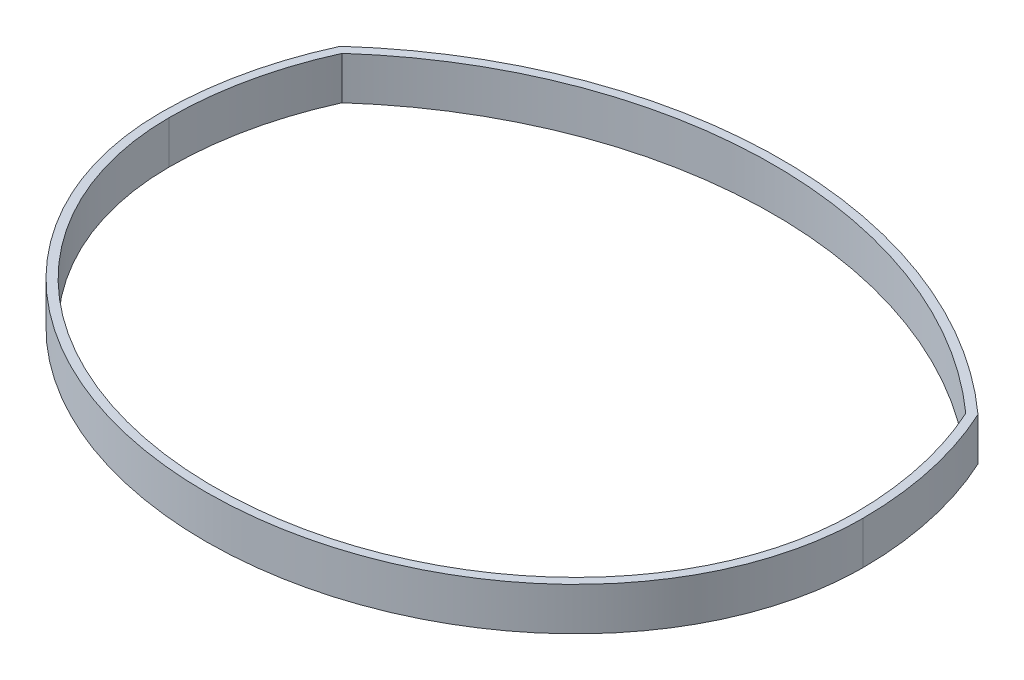
ISO-10303-21;
HEADER;
FILE_DESCRIPTION(('STEP AP214'),'2;1');
FILE_NAME('part.step','',(''),(''),'','','');
FILE_SCHEMA(('AUTOMOTIVE_DESIGN { 1 0 10303 214 1 1 1 1 }'));
ENDSEC;
DATA;
#1=APPLICATION_CONTEXT('core data for automotive mechanical design processes');
#2=APPLICATION_PROTOCOL_DEFINITION('international standard','automotive_design',2000,#1);
#3=PRODUCT_CONTEXT('',#1,'mechanical');
#4=PRODUCT('Part','Part','',(#3));
#5=PRODUCT_RELATED_PRODUCT_CATEGORY('part','',(#4));
#6=PRODUCT_DEFINITION_FORMATION('','',#4);
#7=PRODUCT_DEFINITION_CONTEXT('part definition',#1,'design');
#8=PRODUCT_DEFINITION('design','',#6,#7);
#9=PRODUCT_DEFINITION_SHAPE('','',#8);
#10=(LENGTH_UNIT() NAMED_UNIT(*) SI_UNIT(.MILLI.,.METRE.));
#11=(NAMED_UNIT(*) PLANE_ANGLE_UNIT() SI_UNIT($,.RADIAN.));
#12=(NAMED_UNIT(*) SI_UNIT($,.STERADIAN.) SOLID_ANGLE_UNIT());
#13=UNCERTAINTY_MEASURE_WITH_UNIT(LENGTH_MEASURE(1.E-05),#10,'distance_accuracy_value','');
#14=(GEOMETRIC_REPRESENTATION_CONTEXT(3) GLOBAL_UNCERTAINTY_ASSIGNED_CONTEXT((#13)) GLOBAL_UNIT_ASSIGNED_CONTEXT((#10,
#11,#12)) REPRESENTATION_CONTEXT('',''));
#15=CARTESIAN_POINT('',(0.,0.,0.));
#16=DIRECTION('',(0.,0.,1.));
#17=DIRECTION('',(1.,0.,0.));
#18=AXIS2_PLACEMENT_3D('',#15,#16,#17);
#19=CARTESIAN_POINT('',(0.,12.7,0.));
#20=DIRECTION('',(0.,-1.,0.));
#21=DIRECTION('',(0.,0.,-1.));
#22=AXIS2_PLACEMENT_3D('',#19,#20,#21);
#23=CYLINDRICAL_SURFACE('',#22,104.14);
#24=CARTESIAN_POINT('',(0.,0.,0.));
#25=DIRECTION('',(0.,1.,0.));
#26=DIRECTION('',(0.,0.,1.));
#27=AXIS2_PLACEMENT_3D('',#24,#25,#26);
#28=CIRCLE('',#27,104.14);
#29=CARTESIAN_POINT('',(-94.5401465283261,0.,-43.6726492716279));
#30=VERTEX_POINT('',#29);
#31=CARTESIAN_POINT('',(-104.14,0.,0.));
#32=VERTEX_POINT('',#31);
#33=EDGE_CURVE('E160',#30,#32,#28,.T.);
#34=ORIENTED_EDGE('',*,*,#33,.T.);
#35=DIRECTION('',(0.,-1.,0.));
#36=VECTOR('',#35,1.);
#37=CARTESIAN_POINT('',(-104.14,12.7,0.));
#38=LINE('',#37,#36);
#39=CARTESIAN_POINT('',(-104.14,12.7,0.));
#40=VERTEX_POINT('',#39);
#41=EDGE_CURVE('E11',#40,#32,#38,.T.);
#42=ORIENTED_EDGE('',*,*,#41,.F.);
#43=CARTESIAN_POINT('',(0.,12.7,0.));
#44=DIRECTION('',(0.,1.,0.));
#45=DIRECTION('',(0.,0.,1.));
#46=AXIS2_PLACEMENT_3D('',#43,#44,#45);
#47=CIRCLE('',#46,104.14);
#48=CARTESIAN_POINT('',(-94.5401465283261,12.7,-43.6726492716279));
#49=VERTEX_POINT('',#48);
#50=EDGE_CURVE('E123',#49,#40,#47,.T.);
#51=ORIENTED_EDGE('',*,*,#50,.F.);
#52=DIRECTION('',(0.,-1.,0.));
#53=VECTOR('',#52,1.);
#54=CARTESIAN_POINT('',(-94.5401465283261,12.7,-43.6726492716279));
#55=LINE('',#54,#53);
#56=EDGE_CURVE('E176',#49,#30,#55,.T.);
#57=ORIENTED_EDGE('',*,*,#56,.T.);
#58=EDGE_LOOP('',(#34,#42,#51,#57));
#59=FACE_BOUND('',#58,.T.);
#60=ADVANCED_FACE('F41',(#59),#23,.T.);
#61=CARTESIAN_POINT('',(-104.14,12.7,0.));
#62=CARTESIAN_POINT('',(-104.14,12.7,11.9150162385957));
#63=CARTESIAN_POINT('',(-98.667803670715,12.7,35.7774921744571));
#64=CARTESIAN_POINT('',(-75.4038450147766,12.7,65.9616645273399));
#65=CARTESIAN_POINT('',(-40.7590552264496,12.7,86.04115357399));
#66=CARTESIAN_POINT('',(0.,12.7,93.0736297836365));
#67=CARTESIAN_POINT('',(40.7590552264496,12.7,86.0411535739899));
#68=CARTESIAN_POINT('',(75.4038450147766,12.7,65.9616645273399));
#69=CARTESIAN_POINT('',(98.667803670715,12.7,35.777492174457));
#70=CARTESIAN_POINT('',(104.14,12.7,11.9150162385957));
#71=CARTESIAN_POINT('',(104.14,12.7,0.));
#72=B_SPLINE_CURVE_WITH_KNOTS('',3,(#61,#62,#63,#64,#65,#66,#67,#68,#69,#70,#71),.UNSPECIFIED.,
.F.,.F.,(4,1,1,1,1,1,1,1,4),(0.,0.392699081698724,0.785398163397448,1.17809724509617,
1.5707963267949,1.96349540849362,2.35619449019234,2.74889357189107,3.14159265358979),.UNSPECIFIED.);
#73=DIRECTION('',(0.,-1.,0.));
#74=VECTOR('',#73,1.);
#75=SURFACE_OF_LINEAR_EXTRUSION('',#72,#74);
#76=CARTESIAN_POINT('',(-104.14,0.,0.));
#77=CARTESIAN_POINT('',(-104.14,0.,11.9150162385957));
#78=CARTESIAN_POINT('',(-98.667803670715,0.,35.7774921744571));
#79=CARTESIAN_POINT('',(-75.4038450147766,0.,65.9616645273399));
#80=CARTESIAN_POINT('',(-40.7590552264496,0.,86.04115357399));
#81=CARTESIAN_POINT('',(0.,0.,93.0736297836365));
#82=CARTESIAN_POINT('',(40.7590552264496,0.,86.0411535739899));
#83=CARTESIAN_POINT('',(75.4038450147766,0.,65.9616645273399));
#84=CARTESIAN_POINT('',(98.667803670715,0.,35.777492174457));
#85=CARTESIAN_POINT('',(104.14,0.,11.9150162385957));
#86=CARTESIAN_POINT('',(104.14,0.,0.));
#87=B_SPLINE_CURVE_WITH_KNOTS('',3,(#76,#77,#78,#79,#80,#81,#82,#83,#84,#85,#86),.UNSPECIFIED.,
.F.,.F.,(4,1,1,1,1,1,1,1,4),(0.,0.392699081698724,0.785398163397448,1.17809724509617,
1.5707963267949,1.96349540849362,2.35619449019234,2.74889357189107,3.14159265358979),.UNSPECIFIED.);
#88=CARTESIAN_POINT('',(104.14,0.,0.));
#89=VERTEX_POINT('',#88);
#90=EDGE_CURVE('E129',#32,#89,#87,.T.);
#91=ORIENTED_EDGE('',*,*,#90,.T.);
#92=DIRECTION('',(0.,-1.,0.));
#93=VECTOR('',#92,1.);
#94=CARTESIAN_POINT('',(104.14,12.7,0.));
#95=LINE('',#94,#93);
#96=CARTESIAN_POINT('',(104.14,12.7,0.));
#97=VERTEX_POINT('',#96);
#98=EDGE_CURVE('E52',#97,#89,#95,.T.);
#99=ORIENTED_EDGE('',*,*,#98,.F.);
#100=EDGE_CURVE('E117',#40,#97,#72,.T.);
#101=ORIENTED_EDGE('',*,*,#100,.F.);
#102=ORIENTED_EDGE('',*,*,#41,.T.);
#103=EDGE_LOOP('',(#91,#99,#101,#102));
#104=FACE_BOUND('',#103,.T.);
#105=ADVANCED_FACE('F128',(#104),#75,.F.);
#106=CARTESIAN_POINT('',(0.,12.7,0.));
#107=DIRECTION('',(0.,-1.,0.));
#108=DIRECTION('',(0.,0.,-1.));
#109=AXIS2_PLACEMENT_3D('',#106,#107,#108);
#110=CYLINDRICAL_SURFACE('',#109,104.14);
#111=CARTESIAN_POINT('',(0.,0.,0.));
#112=DIRECTION('',(0.,1.,0.));
#113=DIRECTION('',(0.,0.,1.));
#114=AXIS2_PLACEMENT_3D('',#111,#112,#113);
#115=CIRCLE('',#114,104.14);
#116=CARTESIAN_POINT('',(94.5401465283261,0.,-43.672649271628));
#117=VERTEX_POINT('',#116);
#118=EDGE_CURVE('E90',#89,#117,#115,.T.);
#119=ORIENTED_EDGE('',*,*,#118,.T.);
#120=DIRECTION('',(0.,-1.,0.));
#121=VECTOR('',#120,1.);
#122=CARTESIAN_POINT('',(94.5401465283261,12.7,-43.672649271628));
#123=LINE('',#122,#121);
#124=CARTESIAN_POINT('',(94.5401465283261,12.7,-43.672649271628));
#125=VERTEX_POINT('',#124);
#126=EDGE_CURVE('E131',#125,#117,#123,.T.);
#127=ORIENTED_EDGE('',*,*,#126,.F.);
#128=CARTESIAN_POINT('',(0.,12.7,0.));
#129=DIRECTION('',(0.,1.,0.));
#130=DIRECTION('',(0.,0.,1.));
#131=AXIS2_PLACEMENT_3D('',#128,#129,#130);
#132=CIRCLE('',#131,104.14);
#133=EDGE_CURVE('E121',#97,#125,#132,.T.);
#134=ORIENTED_EDGE('',*,*,#133,.F.);
#135=ORIENTED_EDGE('',*,*,#98,.T.);
#136=EDGE_LOOP('',(#119,#127,#134,#135));
#137=FACE_BOUND('',#136,.T.);
#138=ADVANCED_FACE('F133',(#137),#110,.T.);
#139=CARTESIAN_POINT('',(0.,12.7,0.));
#140=DIRECTION('',(0.,-1.,0.));
#141=DIRECTION('',(0.,0.,-1.));
#142=AXIS2_PLACEMENT_3D('',#139,#140,#141);
#143=CYLINDRICAL_SURFACE('',#142,101.6);
#144=CARTESIAN_POINT('',(0.,0.,0.));
#145=DIRECTION('',(0.,1.,0.));
#146=DIRECTION('',(0.,0.,1.));
#147=AXIS2_PLACEMENT_3D('',#144,#145,#146);
#148=CIRCLE('',#147,101.6);
#149=CARTESIAN_POINT('',(-92.4508074401865,0.,-42.1355930735234));
#150=VERTEX_POINT('',#149);
#151=CARTESIAN_POINT('',(-101.6,0.,0.));
#152=VERTEX_POINT('',#151);
#153=EDGE_CURVE('E144',#150,#152,#148,.T.);
#154=ORIENTED_EDGE('',*,*,#153,.F.);
#155=DIRECTION('',(0.,-1.,0.));
#156=VECTOR('',#155,1.);
#157=CARTESIAN_POINT('',(-92.4508074401865,12.7,-42.1355930735234));
#158=LINE('',#157,#156);
#159=CARTESIAN_POINT('',(-92.4508074401865,12.7,-42.1355930735234));
#160=VERTEX_POINT('',#159);
#161=EDGE_CURVE('E45',#160,#150,#158,.T.);
#162=ORIENTED_EDGE('',*,*,#161,.F.);
#163=CARTESIAN_POINT('',(0.,12.7,0.));
#164=DIRECTION('',(0.,1.,0.));
#165=DIRECTION('',(0.,0.,1.));
#166=AXIS2_PLACEMENT_3D('',#163,#164,#165);
#167=CIRCLE('',#166,101.6);
#168=CARTESIAN_POINT('',(-101.6,12.7,0.));
#169=VERTEX_POINT('',#168);
#170=EDGE_CURVE('E175',#160,#169,#167,.T.);
#171=ORIENTED_EDGE('',*,*,#170,.T.);
#172=DIRECTION('',(0.,-1.,0.));
#173=VECTOR('',#172,1.);
#174=CARTESIAN_POINT('',(-101.6,12.7,0.));
#175=LINE('',#174,#173);
#176=EDGE_CURVE('E137',#169,#152,#175,.T.);
#177=ORIENTED_EDGE('',*,*,#176,.T.);
#178=EDGE_LOOP('',(#154,#162,#171,#177));
#179=FACE_BOUND('',#178,.T.);
#180=ADVANCED_FACE('F43',(#179),#143,.F.);
#181=CARTESIAN_POINT('',(0.,12.7,61.0492054603025));
#182=DIRECTION('',(0.,-1.,0.));
#183=DIRECTION('',(0.,0.,-1.));
#184=AXIS2_PLACEMENT_3D('',#181,#182,#183);
#185=CYLINDRICAL_SURFACE('',#184,138.543330567764);
#186=CARTESIAN_POINT('',(0.,0.,61.0492054603025));
#187=DIRECTION('',(0.,1.,0.));
#188=DIRECTION('',(0.,0.,1.));
#189=AXIS2_PLACEMENT_3D('',#186,#187,#188);
#190=CIRCLE('',#189,138.543330567764);
#191=CARTESIAN_POINT('',(92.4508074401865,0.,-42.1355930735234));
#192=VERTEX_POINT('',#191);
#193=EDGE_CURVE('E148',#192,#150,#190,.T.);
#194=ORIENTED_EDGE('',*,*,#193,.F.);
#195=DIRECTION('',(0.,-1.,0.));
#196=VECTOR('',#195,1.);
#197=CARTESIAN_POINT('',(92.4508074401865,12.7,-42.1355930735234));
#198=LINE('',#197,#196);
#199=CARTESIAN_POINT('',(92.4508074401865,12.7,-42.1355930735234));
#200=VERTEX_POINT('',#199);
#201=EDGE_CURVE('E185',#200,#192,#198,.T.);
#202=ORIENTED_EDGE('',*,*,#201,.F.);
#203=CARTESIAN_POINT('',(0.,12.7,61.0492054603025));
#204=DIRECTION('',(0.,1.,0.));
#205=DIRECTION('',(0.,0.,1.));
#206=AXIS2_PLACEMENT_3D('',#203,#204,#205);
#207=CIRCLE('',#206,138.543330567764);
#208=EDGE_CURVE('E196',#200,#160,#207,.T.);
#209=ORIENTED_EDGE('',*,*,#208,.T.);
#210=ORIENTED_EDGE('',*,*,#161,.T.);
#211=EDGE_LOOP('',(#194,#202,#209,#210));
#212=FACE_BOUND('',#211,.T.);
#213=ADVANCED_FACE('F194',(#212),#185,.F.);
#214=CARTESIAN_POINT('',(0.,12.7,0.));
#215=DIRECTION('',(0.,-1.,0.));
#216=DIRECTION('',(0.,0.,-1.));
#217=AXIS2_PLACEMENT_3D('',#214,#215,#216);
#218=CYLINDRICAL_SURFACE('',#217,101.6);
#219=CARTESIAN_POINT('',(0.,0.,0.));
#220=DIRECTION('',(0.,1.,0.));
#221=DIRECTION('',(0.,0.,1.));
#222=AXIS2_PLACEMENT_3D('',#219,#220,#221);
#223=CIRCLE('',#222,101.6);
#224=CARTESIAN_POINT('',(101.6,0.,0.));
#225=VERTEX_POINT('',#224);
#226=EDGE_CURVE('E152',#225,#192,#223,.T.);
#227=ORIENTED_EDGE('',*,*,#226,.F.);
#228=DIRECTION('',(0.,-1.,0.));
#229=VECTOR('',#228,1.);
#230=CARTESIAN_POINT('',(101.6,12.7,0.));
#231=LINE('',#230,#229);
#232=CARTESIAN_POINT('',(101.6,12.7,0.));
#233=VERTEX_POINT('',#232);
#234=EDGE_CURVE('E183',#233,#225,#231,.T.);
#235=ORIENTED_EDGE('',*,*,#234,.F.);
#236=CARTESIAN_POINT('',(0.,12.7,0.));
#237=DIRECTION('',(0.,1.,0.));
#238=DIRECTION('',(0.,0.,1.));
#239=AXIS2_PLACEMENT_3D('',#236,#237,#238);
#240=CIRCLE('',#239,101.6);
#241=EDGE_CURVE('E203',#233,#200,#240,.T.);
#242=ORIENTED_EDGE('',*,*,#241,.T.);
#243=ORIENTED_EDGE('',*,*,#201,.T.);
#244=EDGE_LOOP('',(#227,#235,#242,#243));
#245=FACE_BOUND('',#244,.T.);
#246=ADVANCED_FACE('F201',(#245),#218,.F.);
#247=CARTESIAN_POINT('',(0.,12.7,0.));
#248=DIRECTION('',(0.,1.,0.));
#249=DIRECTION('',(-1.,0.,0.));
#250=AXIS2_PLACEMENT_3D('',#247,#248,#249);
#251=ELLIPSE('',#250,101.6,88.1894710470876);
#252=DIRECTION('',(0.,-1.,0.));
#253=VECTOR('',#252,1.);
#254=SURFACE_OF_LINEAR_EXTRUSION('',#251,#253);
#255=CARTESIAN_POINT('',(0.,0.,0.));
#256=DIRECTION('',(0.,1.,0.));
#257=DIRECTION('',(-1.,0.,0.));
#258=AXIS2_PLACEMENT_3D('',#255,#256,#257);
#259=ELLIPSE('',#258,101.6,88.1894710470876);
#260=EDGE_CURVE('E156',#152,#225,#259,.T.);
#261=ORIENTED_EDGE('',*,*,#260,.F.);
#262=ORIENTED_EDGE('',*,*,#176,.F.);
#263=EDGE_CURVE('E208',#169,#233,#251,.T.);
#264=ORIENTED_EDGE('',*,*,#263,.T.);
#265=ORIENTED_EDGE('',*,*,#234,.T.);
#266=EDGE_LOOP('',(#261,#262,#264,#265));
#267=FACE_BOUND('',#266,.T.);
#268=ADVANCED_FACE('F211',(#267),#254,.T.);
#269=CARTESIAN_POINT('',(0.,12.7,61.0492054603025));
#270=DIRECTION('',(0.,-1.,0.));
#271=DIRECTION('',(0.,0.,-1.));
#272=AXIS2_PLACEMENT_3D('',#269,#270,#271);
#273=CYLINDRICAL_SURFACE('',#272,141.083330567764);
#274=CARTESIAN_POINT('',(0.,0.,61.0492054603025));
#275=DIRECTION('',(0.,1.,0.));
#276=DIRECTION('',(0.,0.,1.));
#277=AXIS2_PLACEMENT_3D('',#274,#275,#276);
#278=CIRCLE('',#277,141.083330567764);
#279=EDGE_CURVE('E96',#117,#30,#278,.T.);
#280=ORIENTED_EDGE('',*,*,#279,.T.);
#281=ORIENTED_EDGE('',*,*,#56,.F.);
#282=CARTESIAN_POINT('',(0.,12.7,61.0492054603025));
#283=DIRECTION('',(0.,1.,0.));
#284=DIRECTION('',(0.,0.,1.));
#285=AXIS2_PLACEMENT_3D('',#282,#283,#284);
#286=CIRCLE('',#285,141.083330567764);
#287=EDGE_CURVE('E61',#125,#49,#286,.T.);
#288=ORIENTED_EDGE('',*,*,#287,.F.);
#289=ORIENTED_EDGE('',*,*,#126,.T.);
#290=EDGE_LOOP('',(#280,#281,#288,#289));
#291=FACE_BOUND('',#290,.T.);
#292=ADVANCED_FACE('F221',(#291),#273,.T.);
#293=CARTESIAN_POINT('',(0.,12.7,0.));
#294=DIRECTION('',(0.,1.,0.));
#295=DIRECTION('',(0.,0.,1.));
#296=AXIS2_PLACEMENT_3D('',#293,#294,#295);
#297=PLANE('',#296);
#298=ORIENTED_EDGE('',*,*,#170,.F.);
#299=ORIENTED_EDGE('',*,*,#208,.F.);
#300=ORIENTED_EDGE('',*,*,#241,.F.);
#301=ORIENTED_EDGE('',*,*,#263,.F.);
#302=EDGE_LOOP('',(#298,#299,#300,#301));
#303=FACE_BOUND('',#302,.T.);
#304=ORIENTED_EDGE('',*,*,#50,.T.);
#305=ORIENTED_EDGE('',*,*,#100,.T.);
#306=ORIENTED_EDGE('',*,*,#133,.T.);
#307=ORIENTED_EDGE('',*,*,#287,.T.);
#308=EDGE_LOOP('',(#304,#305,#306,#307));
#309=FACE_BOUND('',#308,.T.);
#310=ADVANCED_FACE('F119',(#303,#309),#297,.T.);
#311=CARTESIAN_POINT('',(0.,0.,0.));
#312=DIRECTION('',(0.,1.,0.));
#313=DIRECTION('',(0.,0.,1.));
#314=AXIS2_PLACEMENT_3D('',#311,#312,#313);
#315=PLANE('',#314);
#316=ORIENTED_EDGE('',*,*,#153,.T.);
#317=ORIENTED_EDGE('',*,*,#260,.T.);
#318=ORIENTED_EDGE('',*,*,#226,.T.);
#319=ORIENTED_EDGE('',*,*,#193,.T.);
#320=EDGE_LOOP('',(#316,#317,#318,#319));
#321=FACE_BOUND('',#320,.T.);
#322=ORIENTED_EDGE('',*,*,#33,.F.);
#323=ORIENTED_EDGE('',*,*,#279,.F.);
#324=ORIENTED_EDGE('',*,*,#118,.F.);
#325=ORIENTED_EDGE('',*,*,#90,.F.);
#326=EDGE_LOOP('',(#322,#323,#324,#325));
#327=FACE_BOUND('',#326,.T.);
#328=ADVANCED_FACE('F199',(#321,#327),#315,.F.);
#329=CLOSED_SHELL('',(#60,#105,#138,#180,#213,#246,#268,#292,#310,#328));
#330=MANIFOLD_SOLID_BREP('B2',#329);
#331=ADVANCED_BREP_SHAPE_REPRESENTATION('',(#18,#330),#14);
#332=SHAPE_DEFINITION_REPRESENTATION(#9,#331);
ENDSEC;
END-ISO-10303-21;
